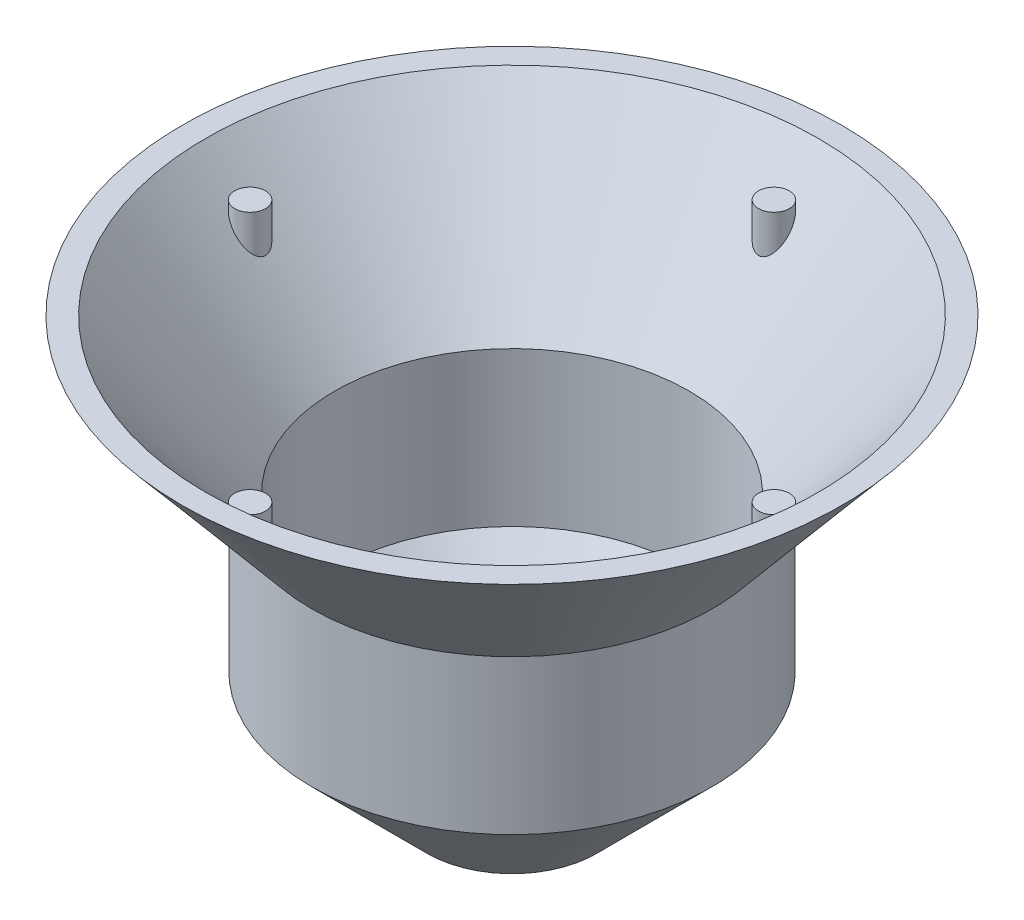
ISO-10303-21;
HEADER;
FILE_DESCRIPTION(('STEP AP214'),'2;1');
FILE_NAME('part.step','',(''),(''),'','','');
FILE_SCHEMA(('AUTOMOTIVE_DESIGN { 1 0 10303 214 1 1 1 1 }'));
ENDSEC;
DATA;
#1=APPLICATION_CONTEXT('core data for automotive mechanical design processes');
#2=APPLICATION_PROTOCOL_DEFINITION('international standard','automotive_design',2000,#1);
#3=PRODUCT_CONTEXT('',#1,'mechanical');
#4=PRODUCT('Part','Part','',(#3));
#5=PRODUCT_RELATED_PRODUCT_CATEGORY('part','',(#4));
#6=PRODUCT_DEFINITION_FORMATION('','',#4);
#7=PRODUCT_DEFINITION_CONTEXT('part definition',#1,'design');
#8=PRODUCT_DEFINITION('design','',#6,#7);
#9=PRODUCT_DEFINITION_SHAPE('','',#8);
#10=(LENGTH_UNIT() NAMED_UNIT(*) SI_UNIT(.MILLI.,.METRE.));
#11=(NAMED_UNIT(*) PLANE_ANGLE_UNIT() SI_UNIT($,.RADIAN.));
#12=(NAMED_UNIT(*) SI_UNIT($,.STERADIAN.) SOLID_ANGLE_UNIT());
#13=UNCERTAINTY_MEASURE_WITH_UNIT(LENGTH_MEASURE(1.E-05),#10,'distance_accuracy_value','');
#14=(GEOMETRIC_REPRESENTATION_CONTEXT(3) GLOBAL_UNCERTAINTY_ASSIGNED_CONTEXT((#13)) GLOBAL_UNIT_ASSIGNED_CONTEXT((#10,
#11,#12)) REPRESENTATION_CONTEXT('',''));
#15=CARTESIAN_POINT('',(0.,0.,0.));
#16=DIRECTION('',(0.,0.,1.));
#17=DIRECTION('',(1.,0.,0.));
#18=AXIS2_PLACEMENT_3D('',#15,#16,#17);
#19=CARTESIAN_POINT('',(0.,10.,0.));
#20=DIRECTION('',(0.,-1.,0.));
#21=DIRECTION('',(0.,0.,-1.));
#22=AXIS2_PLACEMENT_3D('',#19,#20,#21);
#23=CYLINDRICAL_SURFACE('',#22,13.);
#24=CARTESIAN_POINT('',(0.,10.,0.));
#25=DIRECTION('',(0.,1.,0.));
#26=DIRECTION('',(0.,0.,1.));
#27=AXIS2_PLACEMENT_3D('',#24,#25,#26);
#28=CIRCLE('',#27,13.);
#29=CARTESIAN_POINT('',(0.,10.,13.));
#30=VERTEX_POINT('',#29);
#31=EDGE_CURVE('E87',#30,#30,#28,.T.);
#32=ORIENTED_EDGE('',*,*,#31,.F.);
#33=EDGE_LOOP('',(#32));
#34=FACE_BOUND('',#33,.T.);
#35=CARTESIAN_POINT('',(0.,0.,0.));
#36=DIRECTION('',(0.,1.,0.));
#37=DIRECTION('',(0.,0.,1.));
#38=AXIS2_PLACEMENT_3D('',#35,#36,#37);
#39=CIRCLE('',#38,13.);
#40=CARTESIAN_POINT('',(0.,0.,13.));
#41=VERTEX_POINT('',#40);
#42=EDGE_CURVE('E114',#41,#41,#39,.T.);
#43=ORIENTED_EDGE('',*,*,#42,.T.);
#44=EDGE_LOOP('',(#43));
#45=FACE_BOUND('',#44,.T.);
#46=ADVANCED_FACE('F31',(#34,#45),#23,.T.);
#47=CARTESIAN_POINT('',(0.,10.,0.));
#48=DIRECTION('',(0.,-1.,0.));
#49=DIRECTION('',(0.,0.,-1.));
#50=AXIS2_PLACEMENT_3D('',#47,#48,#49);
#51=CYLINDRICAL_SURFACE('',#50,11.5);
#52=CARTESIAN_POINT('',(0.,10.,0.));
#53=DIRECTION('',(0.,1.,0.));
#54=DIRECTION('',(0.,0.,1.));
#55=AXIS2_PLACEMENT_3D('',#52,#53,#54);
#56=CIRCLE('',#55,11.5);
#57=CARTESIAN_POINT('',(0.,10.,11.5));
#58=VERTEX_POINT('',#57);
#59=EDGE_CURVE('E99',#58,#58,#56,.T.);
#60=ORIENTED_EDGE('',*,*,#59,.T.);
#61=EDGE_LOOP('',(#60));
#62=FACE_BOUND('',#61,.T.);
#63=CARTESIAN_POINT('',(0.,0.,0.));
#64=DIRECTION('',(0.,1.,0.));
#65=DIRECTION('',(0.,0.,1.));
#66=AXIS2_PLACEMENT_3D('',#63,#64,#65);
#67=CIRCLE('',#66,11.5);
#68=CARTESIAN_POINT('',(0.,0.,11.5));
#69=VERTEX_POINT('',#68);
#70=EDGE_CURVE('E90',#69,#69,#67,.T.);
#71=ORIENTED_EDGE('',*,*,#70,.F.);
#72=EDGE_LOOP('',(#71));
#73=FACE_BOUND('',#72,.T.);
#74=ADVANCED_FACE('F137',(#62,#73),#51,.F.);
#75=CARTESIAN_POINT('',(0.,20.,0.));
#76=DIRECTION('',(0.,1.,0.));
#77=DIRECTION('',(0.,0.,1.));
#78=AXIS2_PLACEMENT_3D('',#75,#76,#77);
#79=CONICAL_SURFACE('',#78,21.3909963117729,0.698131700797737);
#80=ORIENTED_EDGE('',*,*,#31,.T.);
#81=EDGE_LOOP('',(#80));
#82=FACE_BOUND('',#81,.T.);
#83=CARTESIAN_POINT('',(0.,20.,0.));
#84=DIRECTION('',(0.,1.,0.));
#85=DIRECTION('',(0.,0.,1.));
#86=AXIS2_PLACEMENT_3D('',#83,#84,#85);
#87=CIRCLE('',#86,21.3909963117729);
#88=CARTESIAN_POINT('',(0.,20.,21.3909963117729));
#89=VERTEX_POINT('',#88);
#90=EDGE_CURVE('E93',#89,#89,#87,.T.);
#91=ORIENTED_EDGE('',*,*,#90,.F.);
#92=EDGE_LOOP('',(#91));
#93=FACE_BOUND('',#92,.T.);
#94=ADVANCED_FACE('F142',(#82,#93),#79,.T.);
#95=CARTESIAN_POINT('',(-21.3909963117729,20.,0.));
#96=DIRECTION('',(0.,1.,0.));
#97=DIRECTION('',(0.,0.,1.));
#98=AXIS2_PLACEMENT_3D('',#95,#96,#97);
#99=PLANE('',#98);
#100=ORIENTED_EDGE('',*,*,#90,.T.);
#101=EDGE_LOOP('',(#100));
#102=FACE_BOUND('',#101,.T.);
#103=CARTESIAN_POINT('',(0.,20.,0.));
#104=DIRECTION('',(0.,1.,0.));
#105=DIRECTION('',(0.,0.,1.));
#106=AXIS2_PLACEMENT_3D('',#103,#104,#105);
#107=CIRCLE('',#106,19.8909963117729);
#108=CARTESIAN_POINT('',(0.,20.,19.8909963117729));
#109=VERTEX_POINT('',#108);
#110=EDGE_CURVE('E96',#109,#109,#107,.T.);
#111=ORIENTED_EDGE('',*,*,#110,.F.);
#112=EDGE_LOOP('',(#111));
#113=FACE_BOUND('',#112,.T.);
#114=ADVANCED_FACE('F197',(#102,#113),#99,.T.);
#115=CARTESIAN_POINT('',(0.,10.,0.));
#116=DIRECTION('',(0.,1.,0.));
#117=DIRECTION('',(0.,0.,1.));
#118=AXIS2_PLACEMENT_3D('',#115,#116,#117);
#119=CONICAL_SURFACE('',#118,11.5,0.698131700797737);
#120=CARTESIAN_POINT('',(-0.693648097634615,15.7138111185186,16.2796858802218));
#121=CARTESIAN_POINT('',(-0.739700511551297,15.7689434080156,16.3240275525029));
#122=CARTESIAN_POINT('',(-0.77964367260169,15.8270388604605,16.3709438603008));
#123=CARTESIAN_POINT('',(-0.84896047656184,15.9468628320056,16.4681734821217));
#124=CARTESIAN_POINT('',(-0.878294069416326,16.0086041147832,16.5184988338678));
#125=CARTESIAN_POINT('',(-0.921557113445337,16.119476875896,16.6093125046674));
#126=CARTESIAN_POINT('',(-0.937482321921389,16.1682030111334,16.6493678538314));
#127=CARTESIAN_POINT('',(-0.963909142450238,16.2663868006085,16.7303817947229));
#128=CARTESIAN_POINT('',(-0.974408389514969,16.3158447641801,16.7713407722142));
#129=CARTESIAN_POINT('',(-0.998051125843817,16.4648524296223,16.8952067301308));
#130=CARTESIAN_POINT('',(-1.00331269269217,16.5649642565538,16.9790440789463));
#131=CARTESIAN_POINT('',(-0.992647902891353,16.765241966852,17.1480088359053));
#132=CARTESIAN_POINT('',(-0.976455402158887,16.8653928290829,17.2331392522873));
#133=CARTESIAN_POINT('',(-0.934491713483114,17.0120594496681,17.3586876813447));
#134=CARTESIAN_POINT('',(-0.917585776334701,17.0603048169014,17.4001356507895));
#135=CARTESIAN_POINT('',(-0.877435898058617,17.1550989240135,17.4818491487262));
#136=CARTESIAN_POINT('',(-0.854197967280629,17.2016492255922,17.5221157586227));
#137=CARTESIAN_POINT('',(-0.799961957273627,17.2937677711758,17.6020538549669));
#138=CARTESIAN_POINT('',(-0.768741280913389,17.3392581360569,17.641666036525));
#139=CARTESIAN_POINT('',(-0.69818477232469,17.4264188842058,17.7177926659198));
#140=CARTESIAN_POINT('',(-0.658858216768966,17.4680935562423,17.7543105881165));
#141=CARTESIAN_POINT('',(-0.580679276242016,17.5375183499778,17.8153028594512));
#142=CARTESIAN_POINT('',(-0.543504790728791,17.5663449078743,17.8406868506933));
#143=CARTESIAN_POINT('',(-0.46351427522702,17.619179954676,17.8872924963132));
#144=CARTESIAN_POINT('',(-0.420706846004298,17.643195650895,17.9085203760046));
#145=CARTESIAN_POINT('',(-0.339937586058393,17.6801425542611,17.9412199205076));
#146=CARTESIAN_POINT('',(-0.303018859359443,17.6943511890338,17.9538114739032));
#147=CARTESIAN_POINT('',(-0.226547064883483,17.7180243086807,17.974804594206));
#148=CARTESIAN_POINT('',(-0.186996072057224,17.7274924813185,17.983209418084));
#149=CARTESIAN_POINT('',(-0.105987821480768,17.7410122876946,17.9952143174393));
#150=CARTESIAN_POINT('',(-0.0645203374255681,17.7450302567014,17.9987845303401));
#151=CARTESIAN_POINT('',(0.018685401429839,17.7471752176202,18.0006901905343));
#152=CARTESIAN_POINT('',(0.0604235873234236,17.7453036541725,17.9990269215457));
#153=CARTESIAN_POINT('',(0.138784580218994,17.736301417078,17.9910310685097));
#154=CARTESIAN_POINT('',(0.17551686254252,17.7296868475101,17.9851567232351));
#155=CARTESIAN_POINT('',(0.247132305959229,17.7122409458291,17.9696751574616));
#156=CARTESIAN_POINT('',(0.282014786879367,17.7014080746927,17.9600665745499));
#157=CARTESIAN_POINT('',(0.360495834807384,17.6719389140872,17.9339548878558));
#158=CARTESIAN_POINT('',(0.403160078542386,17.6519066597262,17.9162225134475));
#159=CARTESIAN_POINT('',(0.483585115623437,17.6068981159744,17.8764523023587));
#160=CARTESIAN_POINT('',(0.521336310750953,17.5819123826081,17.8544062425544));
#161=CARTESIAN_POINT('',(0.60646593689021,17.5171395117473,17.7973719279313));
#162=CARTESIAN_POINT('',(0.651368752661686,17.4755045702383,17.7608019752148));
#163=CARTESIAN_POINT('',(0.731941118934938,17.3873783283914,17.6836542649369));
#164=CARTESIAN_POINT('',(0.767593603095403,17.3408782707923,17.643069287692));
#165=CARTESIAN_POINT('',(0.845702053336965,17.2215167007441,17.5392652531611));
#166=CARTESIAN_POINT('',(0.883196107676674,17.1467241407367,17.4745405101532));
#167=CARTESIAN_POINT('',(0.94229671087504,16.9932851627787,17.3425127214851));
#168=CARTESIAN_POINT('',(0.963872652491572,16.9146316289204,17.2752049691697));
#169=CARTESIAN_POINT('',(0.996475693100701,16.7339669280844,17.1215124619584));
#170=CARTESIAN_POINT('',(1.00309474921961,16.6313718432981,17.0348735323414));
#171=CARTESIAN_POINT('',(0.99428746027962,16.4260769830404,16.8628312591243));
#172=CARTESIAN_POINT('',(0.978859502947887,16.3233772004614,16.777428006349));
#173=CARTESIAN_POINT('',(0.931575359314289,16.1452182188842,16.6303866873577));
#174=CARTESIAN_POINT('',(0.904536376386964,16.0691236580535,16.5679539497385));
#175=CARTESIAN_POINT('',(0.835946766516915,15.920627096292,16.4467956150646));
#176=CARTESIAN_POINT('',(0.794431002330629,15.8482166990102,16.3880615086344));
#177=CARTESIAN_POINT('',(0.713728474429132,15.7366911837396,16.2980605766349));
#178=CARTESIAN_POINT('',(0.679690266413876,15.6954087790122,16.2648601881123));
#179=CARTESIAN_POINT('',(0.60447936982374,15.616858732033,16.2018725964703));
#180=CARTESIAN_POINT('',(0.563315425219181,15.57958625905,16.172081283647));
#181=CARTESIAN_POINT('',(0.484627336847496,15.5197766572166,16.1243948898836));
#182=CARTESIAN_POINT('',(0.4488061869311,15.4958946319608,16.1053949497939));
#183=CARTESIAN_POINT('',(0.372800781440757,15.4527933526428,16.0711572143549));
#184=CARTESIAN_POINT('',(0.332623438067618,15.4335668637254,16.0559135809229));
#185=CARTESIAN_POINT('',(0.256901236137627,15.4045403541688,16.0329245056231));
#186=CARTESIAN_POINT('',(0.222061615245524,15.3936204757593,16.0242862454702));
#187=CARTESIAN_POINT('',(0.150543794330798,15.3764737131874,16.0107289671136));
#188=CARTESIAN_POINT('',(0.113867120459315,15.3702430002214,16.0058069145365));
#189=CARTESIAN_POINT('',(0.0395053225241821,15.3629960427774,16.0000825291457));
#190=CARTESIAN_POINT('',(0.00181645788261472,15.3620029661141,15.9992985001816));
#191=CARTESIAN_POINT('',(-0.0731638541864989,15.3653912769664,16.001974517654));
#192=CARTESIAN_POINT('',(-0.110455261838343,15.3697731973868,16.0054349849116));
#193=CARTESIAN_POINT('',(-0.181169663936498,15.3830643835074,16.0159392233189));
#194=CARTESIAN_POINT('',(-0.214688017780169,15.3916689846983,16.0227418896568));
#195=CARTESIAN_POINT('',(-0.279740058764585,15.4126382997328,16.0393363163086));
#196=CARTESIAN_POINT('',(-0.311272447044075,15.4250054441554,16.049130008822));
#197=CARTESIAN_POINT('',(-0.386847191403241,15.4596540118969,16.0766026506037));
#198=CARTESIAN_POINT('',(-0.429470801159146,15.483826741528,16.0957959760847));
#199=CARTESIAN_POINT('',(-0.509246164600164,15.5370937479297,16.1381885978239));
#200=CARTESIAN_POINT('',(-0.546389312915564,15.5661956136943,16.161394072428));
#201=CARTESIAN_POINT('',(-0.622085062401567,15.6337751165912,16.2154197018585));
#202=CARTESIAN_POINT('',(-0.65954197779269,15.6729805015579,16.2468467245686));
#203=CARTESIAN_POINT('',(-0.693648097634615,15.7138111185186,16.2796858802218));
#204=B_SPLINE_CURVE_WITH_KNOTS('',3,(#120,#121,#122,#123,#124,#125,#126,#127,#128,#129,#130,
#131,#132,#133,#134,#135,#136,#137,#138,#139,#140,#141,#142,#143,#144,#145,#146,#147,#148,#149,
#150,#151,#152,#153,#154,#155,#156,#157,#158,#159,#160,#161,#162,#163,#164,#165,#166,#167,#168,
#169,#170,#171,#172,#173,#174,#175,#176,#177,#178,#179,#180,#181,#182,#183,#184,#185,#186,#187,
#188,#189,#190,#191,#192,#193,#194,#195,#196,#197,#198,#199,#200,#201,#202,#203),.UNSPECIFIED.,
.T.,.F.,(4,2,2,2,2,2,2,2,2,2,2,2,2,2,2,2,2,2,2,2,2,2,2,2,2,2,2,2,2,2,2,2,2,2,2,2,2,2,2,2,2,4),
(0.,0.253020805720949,0.506987009411144,0.701912059035902,0.896921998212998,1.28722763016885,
1.68242074044566,1.87959155537915,2.07657586317252,2.27980306927029,2.48279897318545,
2.64262300055478,2.8022057694155,2.92625874953145,3.05021507416089,3.17493361609344,
3.29962156826342,3.41247309811013,3.5253658398285,3.67560713255675,3.82613766879316,
4.03892438246434,4.25210092808417,4.56770515761624,4.88391465850319,5.28531501125232,
5.68674471945169,5.99207092983066,6.29666687924427,6.48511375232543,6.67333100112165,
6.81404991271873,6.95454871850592,7.06664735455373,7.17865436006939,7.29115639697446,
7.40366958881106,7.50904905854552,7.61449674780987,7.77148570645345,7.92871860277114,
8.11610417474206),.UNSPECIFIED.);
#205=CARTESIAN_POINT('',(-0.693648097634615,15.7138111185186,16.2796858802218));
#206=VERTEX_POINT('',#205);
#207=EDGE_CURVE('E10',#206,#206,#204,.T.);
#208=ORIENTED_EDGE('',*,*,#207,.F.);
#209=EDGE_LOOP('',(#208));
#210=FACE_BOUND('',#209,.T.);
#211=CARTESIAN_POINT('',(16.2796858802218,15.7138111185186,-0.693648097634438));
#212=CARTESIAN_POINT('',(16.2480586538147,15.6744870943868,-0.660807963896552));
#213=CARTESIAN_POINT('',(16.2177326697113,15.6366606019949,-0.624840532921883));
#214=CARTESIAN_POINT('',(16.1608300691042,15.5654970205101,-0.546031459641693));
#215=CARTESIAN_POINT('',(16.1342507400993,15.5321566843351,-0.503194839018103));
#216=CARTESIAN_POINT('',(16.0933032835342,15.4806837642439,-0.423440960479858));
#217=CARTESIAN_POINT('',(16.0776070383451,15.4609162104688,-0.388272392389617));
#218=CARTESIAN_POINT('',(16.0498882996769,15.4259653218092,-0.314384217039407));
#219=CARTESIAN_POINT('',(16.0378597965729,15.4107744884245,-0.275670555292053));
#220=CARTESIAN_POINT('',(16.0199309780532,15.3881147004806,-0.201682489398399));
#221=CARTESIAN_POINT('',(16.0133628130781,15.3798050693861,-0.166830660000842));
#222=CARTESIAN_POINT('',(16.0039604715162,15.3679063636439,-0.095834613492482));
#223=CARTESIAN_POINT('',(16.001124066069,15.3643144712442,-0.0596911810783829));
#224=CARTESIAN_POINT('',(15.99942297303,15.3621605376294,0.0129165942872276));
#225=CARTESIAN_POINT('',(16.0005664441127,15.363608828698,0.0493814434177387));
#226=CARTESIAN_POINT('',(16.0067420136282,15.3714266303861,0.121441326919125));
#227=CARTESIAN_POINT('',(16.0117756239023,15.377798054303,0.157036017567083));
#228=CARTESIAN_POINT('',(16.0251844703562,15.3947558821044,0.225684267633237));
#229=CARTESIAN_POINT('',(16.033485992264,15.4052492958857,0.258775877184361));
#230=CARTESIAN_POINT('',(16.0529140758492,15.4297796269386,0.322718148864913));
#231=CARTESIAN_POINT('',(16.0640417963187,15.4438179976925,0.353567885097024));
#232=CARTESIAN_POINT('',(16.0956757594472,15.4836723457184,0.429822318796631));
#233=CARTESIAN_POINT('',(16.1178965713374,15.5116203153281,0.473402680734151));
#234=CARTESIAN_POINT('',(16.1664097565637,15.5724782300511,0.554408233235534));
#235=CARTESIAN_POINT('',(16.1927133313845,15.6054018195414,0.591815887652352));
#236=CARTESIAN_POINT('',(16.2628778927151,15.6929731410243,0.679150429929357));
#237=CARTESIAN_POINT('',(16.3086647056751,15.7498980100045,0.725228568682885));
#238=CARTESIAN_POINT('',(16.4043575960429,15.8682988015739,0.805682406811952));
#239=CARTESIAN_POINT('',(16.4542711432669,15.9297829552509,0.840036281289882));
#240=CARTESIAN_POINT('',(16.5427936951524,16.0382907699558,0.890392008635235));
#241=CARTESIAN_POINT('',(16.5807900893169,16.0847052599738,0.90884408427238));
#242=CARTESIAN_POINT('',(16.6578156870678,16.1784587683777,0.940555503746638));
#243=CARTESIAN_POINT('',(16.6968453383373,16.2257981851035,0.953812556065514));
#244=CARTESIAN_POINT('',(16.8150871342617,16.3686957085286,0.986155714303631));
#245=CARTESIAN_POINT('',(16.8954143205859,16.465086722531,0.997793186164649));
#246=CARTESIAN_POINT('',(17.0586550296888,16.6595650665696,1.00168004177008));
#247=CARTESIAN_POINT('',(17.1415875080003,16.7576457112673,0.993518843448197));
#248=CARTESIAN_POINT('',(17.2648230119886,16.9023738137413,0.965212329355516));
#249=CARTESIAN_POINT('',(17.3056862483914,16.9501929390787,0.953110057244067));
#250=CARTESIAN_POINT('',(17.3866743678703,17.0446462135037,0.923225940436096));
#251=CARTESIAN_POINT('',(17.4267996848952,17.0912810656018,0.905447554515245));
#252=CARTESIAN_POINT('',(17.5138883978272,17.1921689015266,0.85954245661421));
#253=CARTESIAN_POINT('',(17.5605836183382,17.2460432612931,0.830046745629025));
#254=CARTESIAN_POINT('',(17.650961698654,17.3499390051391,0.761228829824383));
#255=CARTESIAN_POINT('',(17.694648452538,17.399965380152,0.721919644370156));
#256=CARTESIAN_POINT('',(17.7666086685162,17.482106712074,0.643718126434686));
#257=CARTESIAN_POINT('',(17.7959821984272,17.5155476355538,0.607245617398587));
#258=CARTESIAN_POINT('',(17.8507185454801,17.5777346951213,0.527821200946043));
#259=CARTESIAN_POINT('',(17.8760876205884,17.6064881588946,0.484879612549772));
#260=CARTESIAN_POINT('',(17.9157178687883,17.6513331871023,0.403707217786449));
#261=CARTESIAN_POINT('',(17.9311826288018,17.6688062861541,0.366834577826187));
#262=CARTESIAN_POINT('',(17.9579629012035,17.6990367552234,0.289769695920478));
#263=CARTESIAN_POINT('',(17.9692813871444,17.711797504815,0.249579858390929));
#264=CARTESIAN_POINT('',(17.9869843865308,17.7317460856342,0.166382041527949));
#265=CARTESIAN_POINT('',(17.9933264826046,17.7388860081405,0.123353153144672));
#266=CARTESIAN_POINT('',(18.0002943101355,17.7467300093991,0.0362593198045996));
#267=CARTESIAN_POINT('',(18.0009240088228,17.7474385547095,-0.00780488480418613));
#268=CARTESIAN_POINT('',(17.9967125680791,17.7426979369991,-0.0895544041690792));
#269=CARTESIAN_POINT('',(17.9925696789943,17.7380346940557,-0.127326497637351));
#270=CARTESIAN_POINT('',(17.980241735176,17.7241491095107,-0.201330047007217));
#271=CARTESIAN_POINT('',(17.9720559385736,17.714925931166,-0.237561218825712));
#272=CARTESIAN_POINT('',(17.9518935655651,17.6921869512204,-0.308716595821987));
#273=CARTESIAN_POINT('',(17.9398168126403,17.6785576745544,-0.343575347047245));
#274=CARTESIAN_POINT('',(17.9126099746621,17.6478159475455,-0.410423989758126));
#275=CARTESIAN_POINT('',(17.8974784203503,17.630701821071,-0.44241249001321));
#276=CARTESIAN_POINT('',(17.8550776757166,17.5826770574833,-0.521416780252716));
#277=CARTESIAN_POINT('',(17.8259278588523,17.5495987733944,-0.566110837135755));
#278=CARTESIAN_POINT('',(17.7634123199915,17.4784647682878,-0.647972295631727));
#279=CARTESIAN_POINT('',(17.7300352271556,17.4403956123749,-0.68511866564728));
#280=CARTESIAN_POINT('',(17.6439235146087,17.3418840040647,-0.768418446536658));
#281=CARTESIAN_POINT('',(17.5895333265973,17.2794131379963,-0.810450873231456));
#282=CARTESIAN_POINT('',(17.4775017147569,17.1501139444438,-0.881127156254674));
#283=CARTESIAN_POINT('',(17.4198557961181,17.0832795718963,-0.909751969587786));
#284=CARTESIAN_POINT('',(17.2805228416504,16.9209175869949,-0.963760851965847));
#285=CARTESIAN_POINT('',(17.1980892977919,16.8242101678751,-0.983698245599764));
#286=CARTESIAN_POINT('',(17.0328210293198,16.6289119092677,-1.00292715291149));
#287=CARTESIAN_POINT('',(16.9499858180596,16.5303168729471,-1.0021655470327));
#288=CARTESIAN_POINT('',(16.7846851707037,16.3321170539926,-0.980156937407497));
#289=CARTESIAN_POINT('',(16.7022482167881,16.2325223295208,-0.958573260985765));
#290=CARTESIAN_POINT('',(16.5821360310311,16.0863522937259,-0.909527976727429));
#291=CARTESIAN_POINT('',(16.5427640961021,16.0382585656806,-0.890455711815123));
#292=CARTESIAN_POINT('',(16.4655561152921,15.943611474085,-0.846372199806994));
#293=CARTESIAN_POINT('',(16.4277183383056,15.8970563860006,-0.821367877754875));
#294=CARTESIAN_POINT('',(16.3717571912647,15.8279674435101,-0.778392813449186));
#295=CARTESIAN_POINT('',(16.3528548372253,15.8045875064064,-0.762772262796922));
#296=CARTESIAN_POINT('',(16.3157255282544,15.7585831823829,-0.729649178311379));
#297=CARTESIAN_POINT('',(16.2974993083806,15.7359596202485,-0.7121446725645));
#298=CARTESIAN_POINT('',(16.2796858802218,15.7138111185186,-0.693648097634438));
#299=B_SPLINE_CURVE_WITH_KNOTS('',3,(#211,#212,#213,#214,#215,#216,#217,#218,#219,#220,#221,
#222,#223,#224,#225,#226,#227,#228,#229,#230,#231,#232,#233,#234,#235,#236,#237,#238,#239,#240,
#241,#242,#243,#244,#245,#246,#247,#248,#249,#250,#251,#252,#253,#254,#255,#256,#257,#258,#259,
#260,#261,#262,#263,#264,#265,#266,#267,#268,#269,#270,#271,#272,#273,#274,#275,#276,#277,#278,
#279,#280,#281,#282,#283,#284,#285,#286,#287,#288,#289,#290,#291,#292,#293,#294,#295,#296,#297,
#298),.UNSPECIFIED.,.T.,.F.,(4,2,2,2,2,2,2,2,2,2,2,2,2,2,2,2,2,2,2,2,2,2,2,2,2,2,2,2,2,2,2,2,2,
2,2,2,2,2,2,2,2,2,2,4),(0.,0.180552776169749,0.360974156996978,0.490404007696254,
0.619620632632096,0.728427944212618,0.837170239124137,0.946135584944688,1.05514329973265,
1.16182136663232,1.26854324426225,1.43659827733662,1.60512281391254,1.8628169329421,
2.120988169873,2.30902420223042,2.49714308393279,2.87356839428929,3.25786644190081,
3.44981167248261,3.6416401625514,3.8724662059164,4.10298762881973,4.27507897189222,
4.44689865801095,4.57731652320585,4.70764067362635,4.83906395599201,4.97039595858142,
5.0847121278709,5.1990492818427,5.31660340184093,5.43421419676113,5.62148696547092,
5.80927462096845,6.08639117585077,6.36390013807977,6.74776696101698,7.13261898887924,
7.52379983826588,7.71861573181762,7.91320530809793,8.01479081150318,8.11648369679742),.UNSPECIFIED.);
#300=CARTESIAN_POINT('',(16.2796858802218,15.7138111185186,-0.693648097634438));
#301=VERTEX_POINT('',#300);
#302=EDGE_CURVE('E41',#301,#301,#299,.T.);
#303=ORIENTED_EDGE('',*,*,#302,.F.);
#304=EDGE_LOOP('',(#303));
#305=FACE_BOUND('',#304,.T.);
#306=CARTESIAN_POINT('',(-0.958983200196196,16.9241447923323,-17.2834629106979));
#307=CARTESIAN_POINT('',(-0.983683897028763,16.8263720257142,-17.1999265598001));
#308=CARTESIAN_POINT('',(-0.996916405651667,16.7265662818479,-17.1152522647833));
#309=CARTESIAN_POINT('',(-1.00213852517421,16.5258394701056,-16.9462250599655));
#310=CARTESIAN_POINT('',(-0.99406932363674,16.4249160820659,-16.8618736852101));
#311=CARTESIAN_POINT('',(-0.959250916664113,16.2398552797126,-16.7083513088111));
#312=CARTESIAN_POINT('',(-0.93550069265134,16.1554806581145,-16.6388086011021));
#313=CARTESIAN_POINT('',(-0.887341040079663,16.0316585457371,-16.5373792867945));
#314=CARTESIAN_POINT('',(-0.869220564044811,15.9908764027096,-16.5040788075557));
#315=CARTESIAN_POINT('',(-0.828517170109277,15.9105842809871,-16.4387142185383));
#316=CARTESIAN_POINT('',(-0.805936777801049,15.8710735969404,-16.4066494212349));
#317=CARTESIAN_POINT('',(-0.751282548523981,15.7866202668842,-16.3383108679246));
#318=CARTESIAN_POINT('',(-0.718223671571984,15.7420380449564,-16.3023667726106));
#319=CARTESIAN_POINT('',(-0.644539163292362,15.6566915761185,-16.2337761766491));
#320=CARTESIAN_POINT('',(-0.603921366046157,15.6159234414279,-16.2011263153947));
#321=CARTESIAN_POINT('',(-0.525357136310589,15.5495846895036,-16.1481443246527));
#322=CARTESIAN_POINT('',(-0.489209736269052,15.5227420916147,-16.1267574746322));
#323=CARTESIAN_POINT('',(-0.411989543141066,15.4737479418096,-16.0877902349723));
#324=CARTESIAN_POINT('',(-0.370924984111657,15.4515887147662,-16.0702036164213));
#325=CARTESIAN_POINT('',(-0.294071664858769,15.4179742727319,-16.043559711752));
#326=CARTESIAN_POINT('',(-0.259209806589467,15.405230690551,-16.0334721495297));
#327=CARTESIAN_POINT('',(-0.187275511913393,15.384410529446,-16.0170020447389));
#328=CARTESIAN_POINT('',(-0.150205074721007,15.3763297984295,-16.0106162059026));
#329=CARTESIAN_POINT('',(-0.0745649616769342,15.3654930585539,-16.0020543144495));
#330=CARTESIAN_POINT('',(-0.0359876295903455,15.3627692649694,-15.9999037314937));
#331=CARTESIAN_POINT('',(0.0411362537634491,15.3630214598304,-16.0001028955796));
#332=CARTESIAN_POINT('',(0.0796828070256905,15.3659970426891,-16.0024523223855));
#333=CARTESIAN_POINT('',(0.152053257701606,15.3768352161052,-16.0110157029096));
#334=CARTESIAN_POINT('',(0.185992144278989,15.3842392934909,-16.016867104006));
#335=CARTESIAN_POINT('',(0.25203761032348,15.4029782336336,-16.0316898567048));
#336=CARTESIAN_POINT('',(0.284143427237649,15.4143147185868,-16.0406624958842));
#337=CARTESIAN_POINT('',(0.35939598355838,15.4458479986573,-16.0656498595775));
#338=CARTESIAN_POINT('',(0.401367998081712,15.4677593576782,-16.0830342058515));
#339=CARTESIAN_POINT('',(0.480308880235248,15.5165068159003,-16.1217928433579));
#340=CARTESIAN_POINT('',(0.517265836336244,15.5433542952199,-16.1431763565843));
#341=CARTESIAN_POINT('',(0.603406491842413,15.6147327554639,-16.2001654318014));
#342=CARTESIAN_POINT('',(0.649582388479635,15.661437063008,-16.2375700824554));
#343=CARTESIAN_POINT('',(0.732222937475564,15.7596352399567,-16.3165343241756));
#344=CARTESIAN_POINT('',(0.76866687367259,15.81113901661,-16.3581025236489));
#345=CARTESIAN_POINT('',(0.825192440440885,15.9043917377065,-16.433683610138));
#346=CARTESIAN_POINT('',(0.847102374459969,15.9455222121411,-16.4671212322122));
#347=CARTESIAN_POINT('',(0.886286489591389,16.0289931447763,-16.5351999386459));
#348=CARTESIAN_POINT('',(0.903558322188432,16.0713342039992,-16.5698416226967));
#349=CARTESIAN_POINT('',(0.948850683061141,16.1996121309921,-16.6751399344941));
#350=CARTESIAN_POINT('',(0.970341570578473,16.2867925170981,-16.7471607278982));
#351=CARTESIAN_POINT('',(0.9974821853232,16.4651892033664,-16.8955206950681));
#352=CARTESIAN_POINT('',(1.00254083328727,16.5564387059732,-16.9719223316869));
#353=CARTESIAN_POINT('',(0.995110005478668,16.7380211354718,-17.124985516285));
#354=CARTESIAN_POINT('',(0.98263113942341,16.8283545832602,-17.2016468791543));
#355=CARTESIAN_POINT('',(0.942966645938006,16.989163660365,-17.3389948283703));
#356=CARTESIAN_POINT('',(0.918986660063298,17.0601800196938,-17.399975340692));
#357=CARTESIAN_POINT('',(0.857242754267674,17.1984248690488,-17.5192684137543));
#358=CARTESIAN_POINT('',(0.819500788213968,17.2656591962851,-17.5775850582295));
#359=CARTESIAN_POINT('',(0.743236528272607,17.3726310925906,-17.6707776314984));
#360=CARTESIAN_POINT('',(0.709001304929707,17.4141732645321,-17.7070851307442));
#361=CARTESIAN_POINT('',(0.632713777915539,17.4929127537912,-17.7760873652258));
#362=CARTESIAN_POINT('',(0.590672910933851,17.5301162997834,-17.8087872758991));
#363=CARTESIAN_POINT('',(0.509940743888862,17.589609680697,-17.8611952981191));
#364=CARTESIAN_POINT('',(0.473066842789087,17.6132969702203,-17.8821023807507));
#365=CARTESIAN_POINT('',(0.394752177404885,17.6559614468263,-17.9198105380423));
#366=CARTESIAN_POINT('',(0.353317752770006,17.6749450560612,-17.9366172106951));
#367=CARTESIAN_POINT('',(0.274179095783154,17.7040540076358,-17.9624123280514));
#368=CARTESIAN_POINT('',(0.237116441012029,17.7151532502686,-17.9722586960807));
#369=CARTESIAN_POINT('',(0.161025263182749,17.7325644281748,-17.9877115048194));
#370=CARTESIAN_POINT('',(0.121998103032215,17.7388796349358,-17.9933208429475));
#371=CARTESIAN_POINT('',(0.0428990828860331,17.7462521444687,-17.9998697986458));
#372=CARTESIAN_POINT('',(0.00282380195989597,17.7472892721889,-18.0007914980687));
#373=CARTESIAN_POINT('',(-0.0769219245758809,17.7439619129756,-17.9978353976683));
#374=CARTESIAN_POINT('',(-0.116592327698374,17.7395968649059,-17.9939570992586));
#375=CARTESIAN_POINT('',(-0.19206795562129,17.726223178608,-17.9820827908299));
#376=CARTESIAN_POINT('',(-0.227964253907093,17.7174960819883,-17.9743364634134));
#377=CARTESIAN_POINT('',(-0.297587393835685,17.6961172991696,-17.955377366958));
#378=CARTESIAN_POINT('',(-0.331313469399001,17.6834642361975,-17.9441633818723));
#379=CARTESIAN_POINT('',(-0.409726915626197,17.6488740132203,-17.9135421935554));
#380=CARTESIAN_POINT('',(-0.453105608274873,17.6252667252692,-17.8926694229706));
#381=CARTESIAN_POINT('',(-0.534239810572741,17.5730850016746,-17.8466261443428));
#382=CARTESIAN_POINT('',(-0.571981762920123,17.5444989375661,-17.8214455774801));
#383=CARTESIAN_POINT('',(-0.65732480458411,17.4703353493881,-17.7562683248804));
#384=CARTESIAN_POINT('',(-0.701965116266052,17.4228130346381,-17.7146249769869));
#385=CARTESIAN_POINT('',(-0.780829008844346,17.3230225216467,-17.6275082491795));
#386=CARTESIAN_POINT('',(-0.815040964418629,17.2707491106071,-17.5820306664846));
#387=CARTESIAN_POINT('',(-0.870388254010096,17.1699831911165,-17.4947138465696));
#388=CARTESIAN_POINT('',(-0.892632332554373,17.1218532325832,-17.453145719693));
#389=CARTESIAN_POINT('',(-0.930585081870585,17.02404205947,-17.3689724355973));
#390=CARTESIAN_POINT('',(-0.946296749923012,16.974361567599,-17.3263677634983));
#391=CARTESIAN_POINT('',(-0.958983200196196,16.9241447923323,-17.2834629106979));
#392=B_SPLINE_CURVE_WITH_KNOTS('',3,(#306,#307,#308,#309,#310,#311,#312,#313,#314,#315,#316,
#317,#318,#319,#320,#321,#322,#323,#324,#325,#326,#327,#328,#329,#330,#331,#332,#333,#334,#335,
#336,#337,#338,#339,#340,#341,#342,#343,#344,#345,#346,#347,#348,#349,#350,#351,#352,#353,#354,
#355,#356,#357,#358,#359,#360,#361,#362,#363,#364,#365,#366,#367,#368,#369,#370,#371,#372,#373,
#374,#375,#376,#377,#378,#379,#380,#381,#382,#383,#384,#385,#386,#387,#388,#389,#390,#391),
.UNSPECIFIED.,.T.,.F.,(4,2,2,2,2,2,2,2,2,2,2,2,2,2,2,2,2,2,2,2,2,2,2,2,2,2,2,2,2,2,2,2,2,2,2,2,
2,2,2,2,2,2,4),(0.,0.392607983583917,0.786301061508907,1.1206524844649,1.28752992520708,
1.45431313498001,1.65218732974201,1.84985757796015,1.9989219411358,2.14774008964534,
2.26268215539673,2.37752171101364,2.49304979635466,2.60856966063383,2.71380825923794,
2.81909032258141,2.96955429419591,3.12036960903376,3.34586736181994,3.57184136686493,
3.74368728367681,3.91562005175957,4.2595325727062,4.61568634547984,4.97162474766671,
5.26065191602301,5.54922001521817,5.743469502603,5.93743659349676,6.0826140341296,
6.22759215128856,6.34685986298307,6.46604594152187,6.58568725931592,6.70534100556582,
6.81811226086513,6.93092310800764,7.09087412136281,7.25120385375997,7.4820234129978,
7.7130993520467,7.91483821904813,8.11648441932962),.UNSPECIFIED.);
#393=CARTESIAN_POINT('',(-0.958983200196196,16.9241447923323,-17.2834629106979));
#394=VERTEX_POINT('',#393);
#395=EDGE_CURVE('E45',#394,#394,#392,.T.);
#396=ORIENTED_EDGE('',*,*,#395,.F.);
#397=EDGE_LOOP('',(#396));
#398=FACE_BOUND('',#397,.T.);
#399=CARTESIAN_POINT('',(-17.2834629106979,16.9241447923323,-0.958983200196256));
#400=CARTESIAN_POINT('',(-17.3522594949583,17.0046646628092,-0.93865530934626));
#401=CARTESIAN_POINT('',(-17.4203527157534,17.0838870033722,-0.910531984422468));
#402=CARTESIAN_POINT('',(-17.5528296696746,17.2371796127492,-0.836727608981688));
#403=CARTESIAN_POINT('',(-17.6172223468727,17.3112624020467,-0.791091132837347));
#404=CARTESIAN_POINT('',(-17.7106243535057,17.4182162893275,-0.704986483077149));
#405=CARTESIAN_POINT('',(-17.7423703166036,17.4544657114813,-0.671664478981048));
#406=CARTESIAN_POINT('',(-17.8025181691089,17.5229873749224,-0.598500697015068));
#407=CARTESIAN_POINT('',(-17.8309242072375,17.5552645527509,-0.558667157806381));
#408=CARTESIAN_POINT('',(-17.8780513681072,17.6087112927921,-0.480318753918058));
#409=CARTESIAN_POINT('',(-17.8975901963102,17.6308292343697,-0.442950856770352));
#410=CARTESIAN_POINT('',(-17.9324312951122,17.6702205114156,-0.363908089581959));
#411=CARTESIAN_POINT('',(-17.9477390334595,17.6875000997658,-0.322238874649439));
#412=CARTESIAN_POINT('',(-17.9707665428068,17.7134727591686,-0.2429147709739));
#413=CARTESIAN_POINT('',(-17.9793447897452,17.7231385789291,-0.205830570641636));
#414=CARTESIAN_POINT('',(-17.9922555177971,17.7376810744769,-0.13001497705834));
#415=CARTESIAN_POINT('',(-17.9965908175999,17.7425609296972,-0.0912846952089595));
#416=CARTESIAN_POINT('',(-18.0006799622787,17.7471638038608,-0.013163573945582));
#417=CARTESIAN_POINT('',(-18.0004211319982,17.7468725557838,0.0262287933151452));
#418=CARTESIAN_POINT('',(-17.9953128786321,17.7411223159558,0.104330616105807));
#419=CARTESIAN_POINT('',(-17.9904624211723,17.7356621597841,0.1430399157568));
#420=CARTESIAN_POINT('',(-17.9768138120432,17.7202866486938,0.21727395092764));
#421=CARTESIAN_POINT('',(-17.96816812983,17.7105433453568,0.252863504669065));
#422=CARTESIAN_POINT('',(-17.9475164198946,17.6872473276939,0.321725659762311));
#423=CARTESIAN_POINT('',(-17.9355090280449,17.6736930669335,0.354997313688941));
#424=CARTESIAN_POINT('',(-17.9025740227395,17.636470618809,0.43348299353454));
#425=CARTESIAN_POINT('',(-17.8800791552674,17.6110128830794,0.477191992260243));
#426=CARTESIAN_POINT('',(-17.8308050085957,17.5551273690906,0.558605007121848));
#427=CARTESIAN_POINT('',(-17.8040159434252,17.5246882354147,0.5962949051276));
#428=CARTESIAN_POINT('',(-17.7346889150115,17.445722047887,0.681514040685483));
#429=CARTESIAN_POINT('',(-17.6904865502107,17.3952169244355,0.725845067070355));
#430=CARTESIAN_POINT('',(-17.5983247384697,17.2894946540728,0.803522607386359));
#431=CARTESIAN_POINT('',(-17.5503584772947,17.2342689439896,0.836848601969854));
#432=CARTESIAN_POINT('',(-17.429889882872,17.0949809570586,0.906649240801103));
#433=CARTESIAN_POINT('',(-17.3561602280461,17.0092382902498,0.937648144161372));
#434=CARTESIAN_POINT('',(-17.2070292594261,16.8346780303615,0.981418713240674));
#435=CARTESIAN_POINT('',(-17.1316258110106,16.745856418732,0.99416556325318));
#436=CARTESIAN_POINT('',(-16.9788165495181,16.5646567672184,1.00278392068616));
#437=CARTESIAN_POINT('',(-16.9014165304841,16.4722505928628,0.998152011810646));
#438=CARTESIAN_POINT('',(-16.748550819661,16.2884903054424,0.970979050932135));
#439=CARTESIAN_POINT('',(-16.6730836813867,16.1971354356026,0.948451820774262));
#440=CARTESIAN_POINT('',(-16.5443852896618,16.0402992087636,0.892212389805836));
#441=CARTESIAN_POINT('',(-16.4902876406124,15.9740283176722,0.862669231171937));
#442=CARTESIAN_POINT('',(-16.3856283524625,15.845196650467,0.79154814905692));
#443=CARTESIAN_POINT('',(-16.3350610822248,15.782629991321,0.749989961081814));
#444=CARTESIAN_POINT('',(-16.2557639876442,15.6840849801679,0.669431192344282));
#445=CARTESIAN_POINT('',(-16.2254202361396,15.6462550781363,0.634293443022495));
#446=CARTESIAN_POINT('',(-16.1683230734133,15.5748829473513,0.557318683251627));
#447=CARTESIAN_POINT('',(-16.1415644016513,15.5413344398369,0.515491690527628));
#448=CARTESIAN_POINT('',(-16.0995617149621,15.4885592213978,0.436634567091062));
#449=CARTESIAN_POINT('',(-16.0831369775324,15.4678821877144,0.401214006917133));
#450=CARTESIAN_POINT('',(-16.0540017580295,15.4311568876037,0.326623837296386));
#451=CARTESIAN_POINT('',(-16.0412859223209,15.4151019498245,0.287459741067081));
#452=CARTESIAN_POINT('',(-16.0223199872975,15.3911358046228,0.212969492200431));
#453=CARTESIAN_POINT('',(-16.0153364612103,15.3823019709998,0.178130489489903));
#454=CARTESIAN_POINT('',(-16.0051000978528,15.3693491401648,0.107051185859205));
#455=CARTESIAN_POINT('',(-16.0018446255284,15.3652268127808,0.070811893440695));
#456=CARTESIAN_POINT('',(-15.9993352089532,15.3620494428181,-0.00212453853426102));
#457=CARTESIAN_POINT('',(-16.0000914613629,15.3630073126508,-0.0388226080230114));
#458=CARTESIAN_POINT('',(-16.0055613393214,15.3699321412004,-0.111441325870829));
#459=CARTESIAN_POINT('',(-16.0102764081446,15.3759009267576,-0.147361685798775));
#460=CARTESIAN_POINT('',(-16.023080784417,15.392096195128,-0.216392487418851));
#461=CARTESIAN_POINT('',(-16.0310639860316,15.4021887735134,-0.249555010923074));
#462=CARTESIAN_POINT('',(-16.0498859123823,15.4259580301593,-0.313691568535846));
#463=CARTESIAN_POINT('',(-16.0607258225002,15.4396361962348,-0.344664687376259));
#464=CARTESIAN_POINT('',(-16.0914494891998,15.4783528408677,-0.420752547964022));
#465=CARTESIAN_POINT('',(-16.113007186487,15.5054748511745,-0.464132038261162));
#466=CARTESIAN_POINT('',(-16.1601821189362,15.5646753991412,-0.544889702702629));
#467=CARTESIAN_POINT('',(-16.1858100334261,15.596766970114,-0.582251553495437));
#468=CARTESIAN_POINT('',(-16.2541738989742,15.6821326263684,-0.669501676483636));
#469=CARTESIAN_POINT('',(-16.2988224383977,15.7376753511197,-0.715653656938761));
#470=CARTESIAN_POINT('',(-16.3922662342921,15.8533738737847,-0.796547109256131));
#471=CARTESIAN_POINT('',(-16.4410708491577,15.9135400511149,-0.83126192427489));
#472=CARTESIAN_POINT('',(-16.5279886466636,16.0201756812681,-0.882624275682766));
#473=CARTESIAN_POINT('',(-16.5654951326976,16.0660344641859,-0.901621494077019));
#474=CARTESIAN_POINT('',(-16.6415675794158,16.1587176852762,-0.934475033343712));
#475=CARTESIAN_POINT('',(-16.6801340562987,16.2055425910659,-0.948328800027633));
#476=CARTESIAN_POINT('',(-16.7968750757602,16.3467724707419,-0.982507617865477));
#477=CARTESIAN_POINT('',(-16.8762185660415,16.4420889730069,-0.995522354782276));
#478=CARTESIAN_POINT('',(-17.0105231314841,16.6022865228789,-1.00142972364729));
#479=CARTESIAN_POINT('',(-17.0652530132819,16.6672520783274,-0.999387383735659));
#480=CARTESIAN_POINT('',(-17.1746218367009,16.7964622314457,-0.986175522888492));
#481=CARTESIAN_POINT('',(-17.2292606720759,16.8607062178691,-0.974998780073954));
#482=CARTESIAN_POINT('',(-17.2834629106979,16.9241447923323,-0.958983200196256));
#483=B_SPLINE_CURVE_WITH_KNOTS('',3,(#399,#400,#401,#402,#403,#404,#405,#406,#407,#408,#409,
#410,#411,#412,#413,#414,#415,#416,#417,#418,#419,#420,#421,#422,#423,#424,#425,#426,#427,#428,
#429,#430,#431,#432,#433,#434,#435,#436,#437,#438,#439,#440,#441,#442,#443,#444,#445,#446,#447,
#448,#449,#450,#451,#452,#453,#454,#455,#456,#457,#458,#459,#460,#461,#462,#463,#464,#465,#466,
#467,#468,#469,#470,#471,#472,#473,#474,#475,#476,#477,#478,#479,#480,#481,#482),.UNSPECIFIED.,
.T.,.F.,(4,2,2,2,2,2,2,2,2,2,2,2,2,2,2,2,2,2,2,2,2,2,2,2,2,2,2,2,2,2,2,2,2,2,2,2,2,2,2,2,2,4),
(0.,0.323285878537327,0.645754331246074,0.821058248421446,0.996142056651593,1.13847719154643,
1.2806275205004,1.39794091144449,1.51517631534358,1.63273522064191,1.75032061521148,
1.86356178068081,1.97684896435416,2.14199378390601,2.3075204441087,2.54749084624207,
2.78790618970032,3.13779064773618,3.48815036256952,3.848736361913,4.20904412519782,
4.47984004507948,4.75019366699344,4.92938477964208,5.10831000851885,5.24040727443572,
5.37231290931526,5.48168697955276,5.59098369445576,5.70055834333896,5.8101729574441,
5.91648010127307,6.02283142654299,6.18843483275931,6.35448015003613,6.60779123329826,
6.86168860483013,7.04809255151966,7.23458894119004,7.60694653122009,7.86144989218932,
8.11615466452667),.UNSPECIFIED.);
#484=CARTESIAN_POINT('',(-17.2834629106979,16.9241447923323,-0.958983200196256));
#485=VERTEX_POINT('',#484);
#486=EDGE_CURVE('E49',#485,#485,#483,.T.);
#487=ORIENTED_EDGE('',*,*,#486,.F.);
#488=EDGE_LOOP('',(#487));
#489=FACE_BOUND('',#488,.T.);
#490=ORIENTED_EDGE('',*,*,#110,.T.);
#491=EDGE_LOOP('',(#490));
#492=FACE_BOUND('',#491,.T.);
#493=ORIENTED_EDGE('',*,*,#59,.F.);
#494=EDGE_LOOP('',(#493));
#495=FACE_BOUND('',#494,.T.);
#496=ADVANCED_FACE('F58',(#210,#305,#398,#489,#492,#495),#119,.F.);
#497=CARTESIAN_POINT('',(-17.,-0.001000000000001,0.));
#498=DIRECTION('',(0.,1.,0.));
#499=DIRECTION('',(0.,0.,1.));
#500=AXIS2_PLACEMENT_3D('',#497,#498,#499);
#501=CYLINDRICAL_SURFACE('',#500,1.);
#502=ORIENTED_EDGE('',*,*,#486,.T.);
#503=EDGE_LOOP('',(#502));
#504=FACE_BOUND('',#503,.T.);
#505=CARTESIAN_POINT('',(-17.,18.,0.));
#506=DIRECTION('',(0.,1.,0.));
#507=DIRECTION('',(0.,0.,1.));
#508=AXIS2_PLACEMENT_3D('',#505,#506,#507);
#509=CIRCLE('',#508,1.);
#510=CARTESIAN_POINT('',(-17.,18.,1.));
#511=VERTEX_POINT('',#510);
#512=EDGE_CURVE('E102',#511,#511,#509,.T.);
#513=ORIENTED_EDGE('',*,*,#512,.F.);
#514=EDGE_LOOP('',(#513));
#515=FACE_BOUND('',#514,.T.);
#516=ADVANCED_FACE('F78',(#504,#515),#501,.T.);
#517=CARTESIAN_POINT('',(-17.,18.,0.));
#518=DIRECTION('',(0.,1.,0.));
#519=DIRECTION('',(0.,0.,1.));
#520=AXIS2_PLACEMENT_3D('',#517,#518,#519);
#521=PLANE('',#520);
#522=ORIENTED_EDGE('',*,*,#512,.T.);
#523=EDGE_LOOP('',(#522));
#524=FACE_BOUND('',#523,.T.);
#525=ADVANCED_FACE('F75',(#524),#521,.T.);
#526=CARTESIAN_POINT('',(0.,-0.001000000000001,-17.));
#527=DIRECTION('',(0.,1.,0.));
#528=DIRECTION('',(0.,0.,1.));
#529=AXIS2_PLACEMENT_3D('',#526,#527,#528);
#530=CYLINDRICAL_SURFACE('',#529,1.);
#531=ORIENTED_EDGE('',*,*,#395,.T.);
#532=EDGE_LOOP('',(#531));
#533=FACE_BOUND('',#532,.T.);
#534=CARTESIAN_POINT('',(0.,18.,-17.));
#535=DIRECTION('',(0.,1.,0.));
#536=DIRECTION('',(-1.,0.,0.));
#537=AXIS2_PLACEMENT_3D('',#534,#535,#536);
#538=CIRCLE('',#537,1.);
#539=CARTESIAN_POINT('',(-0.999999999999942,18.,-17.));
#540=VERTEX_POINT('',#539);
#541=EDGE_CURVE('E105',#540,#540,#538,.T.);
#542=ORIENTED_EDGE('',*,*,#541,.F.);
#543=EDGE_LOOP('',(#542));
#544=FACE_BOUND('',#543,.T.);
#545=ADVANCED_FACE('F70',(#533,#544),#530,.T.);
#546=CARTESIAN_POINT('',(0.,18.,-17.));
#547=DIRECTION('',(0.,1.,0.));
#548=DIRECTION('',(-1.,0.,0.));
#549=AXIS2_PLACEMENT_3D('',#546,#547,#548);
#550=PLANE('',#549);
#551=ORIENTED_EDGE('',*,*,#541,.T.);
#552=EDGE_LOOP('',(#551));
#553=FACE_BOUND('',#552,.T.);
#554=ADVANCED_FACE('F68',(#553),#550,.T.);
#555=CARTESIAN_POINT('',(17.,-0.001000000000001,0.));
#556=DIRECTION('',(0.,1.,0.));
#557=DIRECTION('',(0.,0.,1.));
#558=AXIS2_PLACEMENT_3D('',#555,#556,#557);
#559=CYLINDRICAL_SURFACE('',#558,1.);
#560=ORIENTED_EDGE('',*,*,#302,.T.);
#561=EDGE_LOOP('',(#560));
#562=FACE_BOUND('',#561,.T.);
#563=CARTESIAN_POINT('',(17.,18.,0.));
#564=DIRECTION('',(0.,1.,0.));
#565=DIRECTION('',(0.,0.,-1.));
#566=AXIS2_PLACEMENT_3D('',#563,#564,#565);
#567=CIRCLE('',#566,1.);
#568=CARTESIAN_POINT('',(17.,18.,-1.));
#569=VERTEX_POINT('',#568);
#570=EDGE_CURVE('E108',#569,#569,#567,.T.);
#571=ORIENTED_EDGE('',*,*,#570,.F.);
#572=EDGE_LOOP('',(#571));
#573=FACE_BOUND('',#572,.T.);
#574=ADVANCED_FACE('F62',(#562,#573),#559,.T.);
#575=CARTESIAN_POINT('',(17.,18.,0.));
#576=DIRECTION('',(0.,1.,0.));
#577=DIRECTION('',(0.,0.,-1.));
#578=AXIS2_PLACEMENT_3D('',#575,#576,#577);
#579=PLANE('',#578);
#580=ORIENTED_EDGE('',*,*,#570,.T.);
#581=EDGE_LOOP('',(#580));
#582=FACE_BOUND('',#581,.T.);
#583=ADVANCED_FACE('F67',(#582),#579,.T.);
#584=CARTESIAN_POINT('',(-1.78065548281E-13,-0.001000000000001,17.));
#585=DIRECTION('',(0.,1.,0.));
#586=DIRECTION('',(0.,0.,1.));
#587=AXIS2_PLACEMENT_3D('',#584,#585,#586);
#588=CYLINDRICAL_SURFACE('',#587,1.);
#589=ORIENTED_EDGE('',*,*,#207,.T.);
#590=EDGE_LOOP('',(#589));
#591=FACE_BOUND('',#590,.T.);
#592=CARTESIAN_POINT('',(-1.78065548281E-13,18.,17.));
#593=DIRECTION('',(0.,1.,0.));
#594=DIRECTION('',(1.,0.,0.));
#595=AXIS2_PLACEMENT_3D('',#592,#593,#594);
#596=CIRCLE('',#595,1.);
#597=CARTESIAN_POINT('',(0.999999999999823,18.,17.));
#598=VERTEX_POINT('',#597);
#599=EDGE_CURVE('E111',#598,#598,#596,.T.);
#600=ORIENTED_EDGE('',*,*,#599,.F.);
#601=EDGE_LOOP('',(#600));
#602=FACE_BOUND('',#601,.T.);
#603=ADVANCED_FACE('F155',(#591,#602),#588,.T.);
#604=CARTESIAN_POINT('',(-1.78065548281E-13,18.,17.));
#605=DIRECTION('',(0.,1.,0.));
#606=DIRECTION('',(1.,0.,0.));
#607=AXIS2_PLACEMENT_3D('',#604,#605,#606);
#608=PLANE('',#607);
#609=ORIENTED_EDGE('',*,*,#599,.T.);
#610=EDGE_LOOP('',(#609));
#611=FACE_BOUND('',#610,.T.);
#612=ADVANCED_FACE('F149',(#611),#608,.T.);
#613=CARTESIAN_POINT('',(0.,0.,0.));
#614=DIRECTION('',(0.,1.,0.));
#615=DIRECTION('',(0.,0.,1.));
#616=AXIS2_PLACEMENT_3D('',#613,#614,#615);
#617=CONICAL_SURFACE('',#616,13.,0.785398163397447);
#618=CARTESIAN_POINT('',(0.,-7.5,0.));
#619=DIRECTION('',(0.,1.,0.));
#620=DIRECTION('',(0.,0.,1.));
#621=AXIS2_PLACEMENT_3D('',#618,#619,#620);
#622=CIRCLE('',#621,5.50000000000002);
#623=CARTESIAN_POINT('',(0.,-7.5,5.50000000000002));
#624=VERTEX_POINT('',#623);
#625=EDGE_CURVE('E117',#624,#624,#622,.T.);
#626=ORIENTED_EDGE('',*,*,#625,.T.);
#627=EDGE_LOOP('',(#626));
#628=FACE_BOUND('',#627,.T.);
#629=ORIENTED_EDGE('',*,*,#42,.F.);
#630=EDGE_LOOP('',(#629));
#631=FACE_BOUND('',#630,.T.);
#632=ADVANCED_FACE('F134',(#628,#631),#617,.T.);
#633=CARTESIAN_POINT('',(-5.50000000000002,-7.5,0.));
#634=DIRECTION('',(0.,-1.,0.));
#635=DIRECTION('',(0.,0.,-1.));
#636=AXIS2_PLACEMENT_3D('',#633,#634,#635);
#637=PLANE('',#636);
#638=CARTESIAN_POINT('',(0.,-7.5,0.));
#639=DIRECTION('',(0.,1.,0.));
#640=DIRECTION('',(0.,0.,1.));
#641=AXIS2_PLACEMENT_3D('',#638,#639,#640);
#642=CIRCLE('',#641,4.00000000000002);
#643=CARTESIAN_POINT('',(0.,-7.5,4.00000000000002));
#644=VERTEX_POINT('',#643);
#645=EDGE_CURVE('E120',#644,#644,#642,.T.);
#646=ORIENTED_EDGE('',*,*,#645,.T.);
#647=EDGE_LOOP('',(#646));
#648=FACE_BOUND('',#647,.T.);
#649=ORIENTED_EDGE('',*,*,#625,.F.);
#650=EDGE_LOOP('',(#649));
#651=FACE_BOUND('',#650,.T.);
#652=ADVANCED_FACE('F124',(#648,#651),#637,.T.);
#653=CARTESIAN_POINT('',(0.,-7.5,0.));
#654=DIRECTION('',(0.,1.,0.));
#655=DIRECTION('',(0.,0.,1.));
#656=AXIS2_PLACEMENT_3D('',#653,#654,#655);
#657=CONICAL_SURFACE('',#656,4.00000000000002,0.785398163397447);
#658=ORIENTED_EDGE('',*,*,#70,.T.);
#659=EDGE_LOOP('',(#658));
#660=FACE_BOUND('',#659,.T.);
#661=ORIENTED_EDGE('',*,*,#645,.F.);
#662=EDGE_LOOP('',(#661));
#663=FACE_BOUND('',#662,.T.);
#664=ADVANCED_FACE('F127',(#660,#663),#657,.F.);
#665=CLOSED_SHELL('',(#46,#74,#94,#114,#496,#516,#525,#545,#554,#574,#583,#603,#612,#632,#652,#664));
#666=MANIFOLD_SOLID_BREP('B2',#665);
#667=ADVANCED_BREP_SHAPE_REPRESENTATION('',(#18,#666),#14);
#668=SHAPE_DEFINITION_REPRESENTATION(#9,#667);
ENDSEC;
END-ISO-10303-21;
